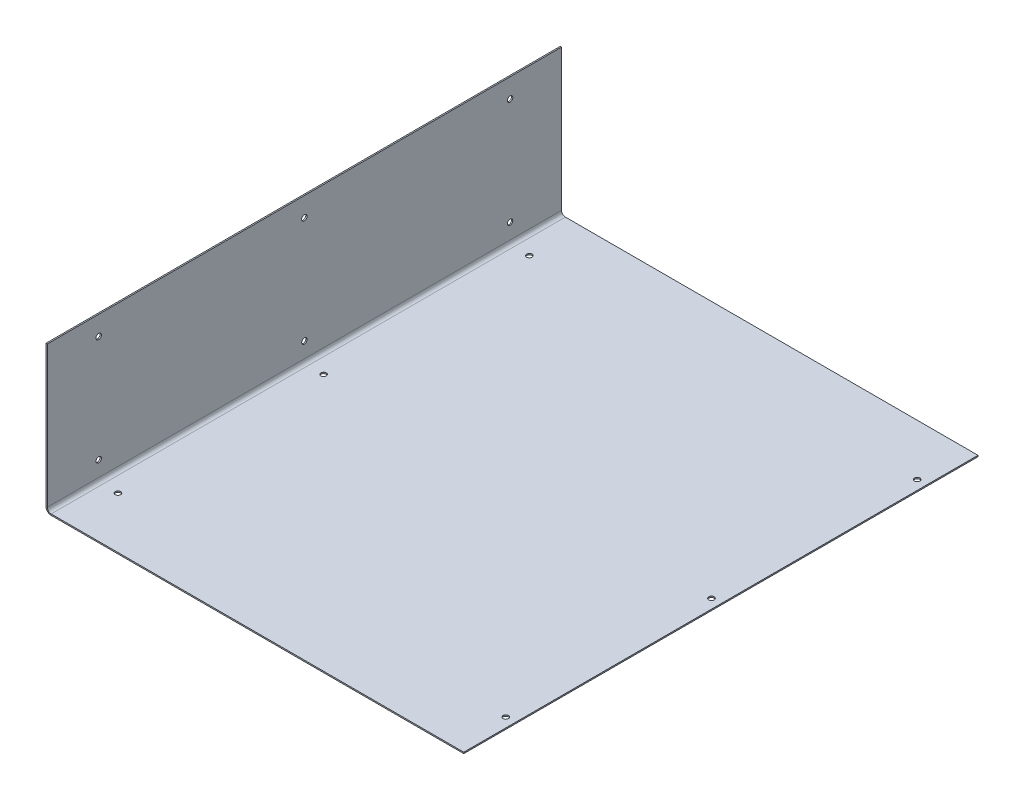
ISO-10303-21;
HEADER;
FILE_DESCRIPTION(('STEP AP214'),'2;1');
FILE_NAME('part.step','',(''),(''),'','','');
FILE_SCHEMA(('AUTOMOTIVE_DESIGN { 1 0 10303 214 1 1 1 1 }'));
ENDSEC;
DATA;
#1=APPLICATION_CONTEXT('core data for automotive mechanical design processes');
#2=APPLICATION_PROTOCOL_DEFINITION('international standard','automotive_design',2000,#1);
#3=PRODUCT_CONTEXT('',#1,'mechanical');
#4=PRODUCT('Part','Part','',(#3));
#5=PRODUCT_RELATED_PRODUCT_CATEGORY('part','',(#4));
#6=PRODUCT_DEFINITION_FORMATION('','',#4);
#7=PRODUCT_DEFINITION_CONTEXT('part definition',#1,'design');
#8=PRODUCT_DEFINITION('design','',#6,#7);
#9=PRODUCT_DEFINITION_SHAPE('','',#8);
#10=(LENGTH_UNIT() NAMED_UNIT(*) SI_UNIT(.MILLI.,.METRE.));
#11=(NAMED_UNIT(*) PLANE_ANGLE_UNIT() SI_UNIT($,.RADIAN.));
#12=(NAMED_UNIT(*) SI_UNIT($,.STERADIAN.) SOLID_ANGLE_UNIT());
#13=UNCERTAINTY_MEASURE_WITH_UNIT(LENGTH_MEASURE(1.E-05),#10,'distance_accuracy_value','');
#14=(GEOMETRIC_REPRESENTATION_CONTEXT(3) GLOBAL_UNCERTAINTY_ASSIGNED_CONTEXT((#13)) GLOBAL_UNIT_ASSIGNED_CONTEXT((#10,
#11,#12)) REPRESENTATION_CONTEXT('',''));
#15=CARTESIAN_POINT('',(0.,0.,0.));
#16=DIRECTION('',(0.,0.,1.));
#17=DIRECTION('',(1.,0.,0.));
#18=AXIS2_PLACEMENT_3D('',#15,#16,#17);
#19=CARTESIAN_POINT('',(-1.,57.,-200.));
#20=DIRECTION('',(0.,0.,-1.));
#21=DIRECTION('',(-1.,0.,0.));
#22=AXIS2_PLACEMENT_3D('',#19,#20,#21);
#23=PLANE('',#22);
#24=DIRECTION('',(0.,1.,0.));
#25=VECTOR('',#24,1.);
#26=CARTESIAN_POINT('',(0.,57.,-200.));
#27=LINE('',#26,#25);
#28=CARTESIAN_POINT('',(0.,-53.,-200.));
#29=VERTEX_POINT('',#28);
#30=CARTESIAN_POINT('',(0.,57.,-200.));
#31=VERTEX_POINT('',#30);
#32=EDGE_CURVE('E107',#29,#31,#27,.T.);
#33=ORIENTED_EDGE('',*,*,#32,.F.);
#34=DIRECTION('',(-1.,0.,0.));
#35=VECTOR('',#34,1.);
#36=CARTESIAN_POINT('',(0.,-53.,-200.));
#37=LINE('',#36,#35);
#38=CARTESIAN_POINT('',(-0.999999999999997,-53.,-200.));
#39=VERTEX_POINT('',#38);
#40=EDGE_CURVE('E232',#29,#39,#37,.T.);
#41=ORIENTED_EDGE('',*,*,#40,.T.);
#42=DIRECTION('',(0.,1.,0.));
#43=VECTOR('',#42,1.);
#44=CARTESIAN_POINT('',(-1.,57.,-200.));
#45=LINE('',#44,#43);
#46=CARTESIAN_POINT('',(-1.,57.,-200.));
#47=VERTEX_POINT('',#46);
#48=EDGE_CURVE('E104',#39,#47,#45,.T.);
#49=ORIENTED_EDGE('',*,*,#48,.T.);
#50=DIRECTION('',(1.,0.,0.));
#51=VECTOR('',#50,1.);
#52=CARTESIAN_POINT('',(-1.,57.,-200.));
#53=LINE('',#52,#51);
#54=EDGE_CURVE('E65',#47,#31,#53,.T.);
#55=ORIENTED_EDGE('',*,*,#54,.T.);
#56=EDGE_LOOP('',(#33,#41,#49,#55));
#57=FACE_BOUND('',#56,.T.);
#58=ADVANCED_FACE('F57',(#57),#23,.T.);
#59=CARTESIAN_POINT('',(-1.,0.,0.));
#60=DIRECTION('',(1.,0.,0.));
#61=DIRECTION('',(0.,0.,-1.));
#62=AXIS2_PLACEMENT_3D('',#59,#60,#61);
#63=PLANE('',#62);
#64=CARTESIAN_POINT('',(-1.00000000000044,-40.999999999999,-159.999999999999));
#65=DIRECTION('',(-1.,0.,0.));
#66=DIRECTION('',(0.,0.,1.));
#67=AXIS2_PLACEMENT_3D('',#64,#65,#66);
#68=CIRCLE('',#67,2.1);
#69=CARTESIAN_POINT('',(-1.00000000000044,-40.999999999999,-157.899999999999));
#70=VERTEX_POINT('',#69);
#71=EDGE_CURVE('E137',#70,#70,#68,.T.);
#72=ORIENTED_EDGE('',*,*,#71,.F.);
#73=EDGE_LOOP('',(#72));
#74=FACE_BOUND('',#73,.T.);
#75=CARTESIAN_POINT('',(-1.00000000000044,-40.9999999999993,6.66133814775094E-13));
#76=DIRECTION('',(-1.,0.,0.));
#77=DIRECTION('',(0.,0.,1.));
#78=AXIS2_PLACEMENT_3D('',#75,#76,#77);
#79=CIRCLE('',#78,2.1);
#80=CARTESIAN_POINT('',(-1.00000000000044,-40.9999999999993,2.10000000000066));
#81=VERTEX_POINT('',#80);
#82=EDGE_CURVE('E133',#81,#81,#79,.T.);
#83=ORIENTED_EDGE('',*,*,#82,.F.);
#84=EDGE_LOOP('',(#83));
#85=FACE_BOUND('',#84,.T.);
#86=CARTESIAN_POINT('',(-1.00000000000044,-40.9999999999995,160.000000000001));
#87=DIRECTION('',(-1.,0.,0.));
#88=DIRECTION('',(0.,0.,1.));
#89=AXIS2_PLACEMENT_3D('',#86,#87,#88);
#90=CIRCLE('',#89,2.1);
#91=CARTESIAN_POINT('',(-1.00000000000044,-40.9999999999995,162.100000000001));
#92=VERTEX_POINT('',#91);
#93=EDGE_CURVE('E132',#92,#92,#90,.T.);
#94=ORIENTED_EDGE('',*,*,#93,.F.);
#95=EDGE_LOOP('',(#94));
#96=FACE_BOUND('',#95,.T.);
#97=CARTESIAN_POINT('',(-1.00000000000311,42.0000000000027,160.000000000001));
#98=DIRECTION('',(-1.,0.,0.));
#99=DIRECTION('',(0.,0.,1.));
#100=AXIS2_PLACEMENT_3D('',#97,#98,#99);
#101=CIRCLE('',#100,2.1);
#102=CARTESIAN_POINT('',(-1.00000000000311,42.0000000000027,162.100000000001));
#103=VERTEX_POINT('',#102);
#104=EDGE_CURVE('E128',#103,#103,#101,.T.);
#105=ORIENTED_EDGE('',*,*,#104,.F.);
#106=EDGE_LOOP('',(#105));
#107=FACE_BOUND('',#106,.T.);
#108=CARTESIAN_POINT('',(-1.00000000000311,42.0000000000029,9.99200722162641E-13));
#109=DIRECTION('',(-1.,0.,0.));
#110=DIRECTION('',(0.,0.,1.));
#111=AXIS2_PLACEMENT_3D('',#108,#109,#110);
#112=CIRCLE('',#111,2.1);
#113=CARTESIAN_POINT('',(-1.00000000000311,42.0000000000029,2.100000000001));
#114=VERTEX_POINT('',#113);
#115=EDGE_CURVE('E124',#114,#114,#112,.T.);
#116=ORIENTED_EDGE('',*,*,#115,.F.);
#117=EDGE_LOOP('',(#116));
#118=FACE_BOUND('',#117,.T.);
#119=CARTESIAN_POINT('',(-1.00000000000311,42.000000000003,-159.999999999999));
#120=DIRECTION('',(-1.,0.,0.));
#121=DIRECTION('',(0.,0.,1.));
#122=AXIS2_PLACEMENT_3D('',#119,#120,#121);
#123=CIRCLE('',#122,2.1);
#124=CARTESIAN_POINT('',(-1.00000000000311,42.000000000003,-157.899999999999));
#125=VERTEX_POINT('',#124);
#126=EDGE_CURVE('E123',#125,#125,#123,.T.);
#127=ORIENTED_EDGE('',*,*,#126,.F.);
#128=EDGE_LOOP('',(#127));
#129=FACE_BOUND('',#128,.T.);
#130=DIRECTION('',(0.,0.,-1.));
#131=VECTOR('',#130,1.);
#132=CARTESIAN_POINT('',(-0.999999999999997,-53.,-200.));
#133=LINE('',#132,#131);
#134=CARTESIAN_POINT('',(-1.,-53.,200.));
#135=VERTEX_POINT('',#134);
#136=EDGE_CURVE('E225',#39,#135,#133,.F.);
#137=ORIENTED_EDGE('',*,*,#136,.T.);
#138=DIRECTION('',(0.,-1.,0.));
#139=VECTOR('',#138,1.);
#140=CARTESIAN_POINT('',(-1.,57.,200.));
#141=LINE('',#140,#139);
#142=CARTESIAN_POINT('',(-1.,57.,200.));
#143=VERTEX_POINT('',#142);
#144=EDGE_CURVE('E114',#143,#135,#141,.T.);
#145=ORIENTED_EDGE('',*,*,#144,.F.);
#146=DIRECTION('',(0.,0.,1.));
#147=VECTOR('',#146,1.);
#148=CARTESIAN_POINT('',(-1.,57.,200.));
#149=LINE('',#148,#147);
#150=EDGE_CURVE('E97',#47,#143,#149,.T.);
#151=ORIENTED_EDGE('',*,*,#150,.F.);
#152=ORIENTED_EDGE('',*,*,#48,.F.);
#153=EDGE_LOOP('',(#137,#145,#151,#152));
#154=FACE_BOUND('',#153,.T.);
#155=ADVANCED_FACE('F300',(#74,#85,#96,#107,#118,#129,#154),#63,.F.);
#156=CARTESIAN_POINT('',(0.,0.,0.));
#157=DIRECTION('',(1.,0.,0.));
#158=DIRECTION('',(0.,0.,-1.));
#159=AXIS2_PLACEMENT_3D('',#156,#157,#158);
#160=PLANE('',#159);
#161=CARTESIAN_POINT('',(0.,-40.999999999999,-159.999999999999));
#162=DIRECTION('',(1.,0.,0.));
#163=DIRECTION('',(0.,0.,-1.));
#164=AXIS2_PLACEMENT_3D('',#161,#162,#163);
#165=CIRCLE('',#164,2.1);
#166=CARTESIAN_POINT('',(0.,-40.999999999999,-162.099999999999));
#167=VERTEX_POINT('',#166);
#168=EDGE_CURVE('E134',#167,#167,#165,.T.);
#169=ORIENTED_EDGE('',*,*,#168,.F.);
#170=EDGE_LOOP('',(#169));
#171=FACE_BOUND('',#170,.T.);
#172=CARTESIAN_POINT('',(0.,-40.9999999999993,6.66133814775094E-13));
#173=DIRECTION('',(1.,0.,0.));
#174=DIRECTION('',(0.,0.,-1.));
#175=AXIS2_PLACEMENT_3D('',#172,#173,#174);
#176=CIRCLE('',#175,2.1);
#177=CARTESIAN_POINT('',(0.,-40.9999999999993,-2.09999999999933));
#178=VERTEX_POINT('',#177);
#179=EDGE_CURVE('E129',#178,#178,#176,.T.);
#180=ORIENTED_EDGE('',*,*,#179,.F.);
#181=EDGE_LOOP('',(#180));
#182=FACE_BOUND('',#181,.T.);
#183=CARTESIAN_POINT('',(0.,-40.9999999999995,160.000000000001));
#184=DIRECTION('',(1.,0.,0.));
#185=DIRECTION('',(0.,0.,-1.));
#186=AXIS2_PLACEMENT_3D('',#183,#184,#185);
#187=CIRCLE('',#186,2.1);
#188=CARTESIAN_POINT('',(0.,-40.9999999999995,157.900000000001));
#189=VERTEX_POINT('',#188);
#190=EDGE_CURVE('E163',#189,#189,#187,.T.);
#191=ORIENTED_EDGE('',*,*,#190,.F.);
#192=EDGE_LOOP('',(#191));
#193=FACE_BOUND('',#192,.T.);
#194=CARTESIAN_POINT('',(0.,42.0000000000027,160.000000000001));
#195=DIRECTION('',(1.,0.,0.));
#196=DIRECTION('',(0.,0.,-1.));
#197=AXIS2_PLACEMENT_3D('',#194,#195,#196);
#198=CIRCLE('',#197,2.1);
#199=CARTESIAN_POINT('',(0.,42.0000000000027,157.900000000001));
#200=VERTEX_POINT('',#199);
#201=EDGE_CURVE('E125',#200,#200,#198,.T.);
#202=ORIENTED_EDGE('',*,*,#201,.F.);
#203=EDGE_LOOP('',(#202));
#204=FACE_BOUND('',#203,.T.);
#205=CARTESIAN_POINT('',(0.,42.0000000000029,9.99200722162641E-13));
#206=DIRECTION('',(1.,0.,0.));
#207=DIRECTION('',(0.,0.,-1.));
#208=AXIS2_PLACEMENT_3D('',#205,#206,#207);
#209=CIRCLE('',#208,2.1);
#210=CARTESIAN_POINT('',(0.,42.0000000000029,-2.099999999999));
#211=VERTEX_POINT('',#210);
#212=EDGE_CURVE('E120',#211,#211,#209,.T.);
#213=ORIENTED_EDGE('',*,*,#212,.F.);
#214=EDGE_LOOP('',(#213));
#215=FACE_BOUND('',#214,.T.);
#216=CARTESIAN_POINT('',(0.,42.000000000003,-159.999999999999));
#217=DIRECTION('',(1.,0.,0.));
#218=DIRECTION('',(0.,0.,-1.));
#219=AXIS2_PLACEMENT_3D('',#216,#217,#218);
#220=CIRCLE('',#219,2.1);
#221=CARTESIAN_POINT('',(0.,42.000000000003,-162.099999999999));
#222=VERTEX_POINT('',#221);
#223=EDGE_CURVE('E172',#222,#222,#220,.T.);
#224=ORIENTED_EDGE('',*,*,#223,.F.);
#225=EDGE_LOOP('',(#224));
#226=FACE_BOUND('',#225,.T.);
#227=DIRECTION('',(0.,-1.,0.));
#228=VECTOR('',#227,1.);
#229=CARTESIAN_POINT('',(0.,57.,200.));
#230=LINE('',#229,#228);
#231=CARTESIAN_POINT('',(0.,57.,200.));
#232=VERTEX_POINT('',#231);
#233=CARTESIAN_POINT('',(0.,-53.,200.));
#234=VERTEX_POINT('',#233);
#235=EDGE_CURVE('E99',#232,#234,#230,.T.);
#236=ORIENTED_EDGE('',*,*,#235,.T.);
#237=DIRECTION('',(0.,0.,-1.));
#238=VECTOR('',#237,1.);
#239=CARTESIAN_POINT('',(0.,-53.,-200.));
#240=LINE('',#239,#238);
#241=EDGE_CURVE('E73',#29,#234,#240,.F.);
#242=ORIENTED_EDGE('',*,*,#241,.F.);
#243=ORIENTED_EDGE('',*,*,#32,.T.);
#244=DIRECTION('',(0.,0.,1.));
#245=VECTOR('',#244,1.);
#246=CARTESIAN_POINT('',(0.,57.,200.));
#247=LINE('',#246,#245);
#248=EDGE_CURVE('E95',#31,#232,#247,.T.);
#249=ORIENTED_EDGE('',*,*,#248,.T.);
#250=EDGE_LOOP('',(#236,#242,#243,#249));
#251=FACE_BOUND('',#250,.T.);
#252=ADVANCED_FACE('F106',(#171,#182,#193,#204,#215,#226,#251),#160,.T.);
#253=CARTESIAN_POINT('',(-1.,57.,200.));
#254=DIRECTION('',(0.,0.,1.));
#255=DIRECTION('',(0.,-1.,0.));
#256=AXIS2_PLACEMENT_3D('',#253,#254,#255);
#257=PLANE('',#256);
#258=DIRECTION('',(-1.,0.,0.));
#259=VECTOR('',#258,1.);
#260=CARTESIAN_POINT('',(0.,-53.,200.));
#261=LINE('',#260,#259);
#262=EDGE_CURVE('E103',#234,#135,#261,.T.);
#263=ORIENTED_EDGE('',*,*,#262,.F.);
#264=ORIENTED_EDGE('',*,*,#235,.F.);
#265=DIRECTION('',(1.,0.,0.));
#266=VECTOR('',#265,1.);
#267=CARTESIAN_POINT('',(-1.,57.,200.));
#268=LINE('',#267,#266);
#269=EDGE_CURVE('E13',#143,#232,#268,.T.);
#270=ORIENTED_EDGE('',*,*,#269,.F.);
#271=ORIENTED_EDGE('',*,*,#144,.T.);
#272=EDGE_LOOP('',(#263,#264,#270,#271));
#273=FACE_BOUND('',#272,.T.);
#274=ADVANCED_FACE('F100',(#273),#257,.T.);
#275=CARTESIAN_POINT('',(-1.,57.,200.));
#276=DIRECTION('',(0.,1.,0.));
#277=DIRECTION('',(0.,0.,1.));
#278=AXIS2_PLACEMENT_3D('',#275,#276,#277);
#279=PLANE('',#278);
#280=ORIENTED_EDGE('',*,*,#248,.F.);
#281=ORIENTED_EDGE('',*,*,#54,.F.);
#282=ORIENTED_EDGE('',*,*,#150,.T.);
#283=ORIENTED_EDGE('',*,*,#269,.T.);
#284=EDGE_LOOP('',(#280,#281,#282,#283));
#285=FACE_BOUND('',#284,.T.);
#286=ADVANCED_FACE('F92',(#285),#279,.T.);
#287=CARTESIAN_POINT('',(3.00000000000001,-53.,200.));
#288=DIRECTION('',(0.,0.,1.));
#289=DIRECTION('',(1.,0.,0.));
#290=AXIS2_PLACEMENT_3D('',#287,#288,#289);
#291=PLANE('',#290);
#292=DIRECTION('',(0.,1.,0.));
#293=VECTOR('',#292,1.);
#294=CARTESIAN_POINT('',(2.99999999999999,-57.,200.));
#295=LINE('',#294,#293);
#296=CARTESIAN_POINT('',(3.,-56.,200.));
#297=VERTEX_POINT('',#296);
#298=CARTESIAN_POINT('',(2.99999999999999,-57.,200.));
#299=VERTEX_POINT('',#298);
#300=EDGE_CURVE('E118',#297,#299,#295,.F.);
#301=ORIENTED_EDGE('',*,*,#300,.F.);
#302=CARTESIAN_POINT('',(3.00000000000001,-53.,200.));
#303=DIRECTION('',(0.,0.,-1.));
#304=DIRECTION('',(-1.,0.,0.));
#305=AXIS2_PLACEMENT_3D('',#302,#303,#304);
#306=CIRCLE('',#305,3.);
#307=EDGE_CURVE('E235',#234,#297,#306,.F.);
#308=ORIENTED_EDGE('',*,*,#307,.F.);
#309=ORIENTED_EDGE('',*,*,#262,.T.);
#310=CARTESIAN_POINT('',(3.00000000000001,-53.,200.));
#311=DIRECTION('',(0.,0.,-1.));
#312=DIRECTION('',(-1.,0.,0.));
#313=AXIS2_PLACEMENT_3D('',#310,#311,#312);
#314=CIRCLE('',#313,4.);
#315=EDGE_CURVE('E228',#135,#299,#314,.F.);
#316=ORIENTED_EDGE('',*,*,#315,.T.);
#317=EDGE_LOOP('',(#301,#308,#309,#316));
#318=FACE_BOUND('',#317,.T.);
#319=ADVANCED_FACE('F250',(#318),#291,.T.);
#320=CARTESIAN_POINT('',(3.00000000000001,-53.,-200.));
#321=DIRECTION('',(0.,0.,1.));
#322=DIRECTION('',(1.,0.,0.));
#323=AXIS2_PLACEMENT_3D('',#320,#321,#322);
#324=PLANE('',#323);
#325=CARTESIAN_POINT('',(3.00000000000001,-53.,-200.));
#326=DIRECTION('',(0.,0.,-1.));
#327=DIRECTION('',(-1.,0.,0.));
#328=AXIS2_PLACEMENT_3D('',#325,#326,#327);
#329=CIRCLE('',#328,3.);
#330=CARTESIAN_POINT('',(3.,-56.,-200.));
#331=VERTEX_POINT('',#330);
#332=EDGE_CURVE('E192',#331,#29,#329,.T.);
#333=ORIENTED_EDGE('',*,*,#332,.F.);
#334=DIRECTION('',(0.,1.,0.));
#335=VECTOR('',#334,1.);
#336=CARTESIAN_POINT('',(3.,-56.,-200.));
#337=LINE('',#336,#335);
#338=CARTESIAN_POINT('',(3.,-57.,-200.));
#339=VERTEX_POINT('',#338);
#340=EDGE_CURVE('E217',#331,#339,#337,.F.);
#341=ORIENTED_EDGE('',*,*,#340,.T.);
#342=CARTESIAN_POINT('',(3.00000000000001,-53.,-200.));
#343=DIRECTION('',(0.,0.,-1.));
#344=DIRECTION('',(-1.,0.,0.));
#345=AXIS2_PLACEMENT_3D('',#342,#343,#344);
#346=CIRCLE('',#345,4.);
#347=EDGE_CURVE('E229',#339,#39,#346,.T.);
#348=ORIENTED_EDGE('',*,*,#347,.T.);
#349=ORIENTED_EDGE('',*,*,#40,.F.);
#350=EDGE_LOOP('',(#333,#341,#348,#349));
#351=FACE_BOUND('',#350,.T.);
#352=ADVANCED_FACE('F298',(#351),#324,.F.);
#353=CARTESIAN_POINT('',(3.00000000000001,-53.,-200.));
#354=DIRECTION('',(0.,0.,-1.));
#355=DIRECTION('',(0.,-1.,0.));
#356=AXIS2_PLACEMENT_3D('',#353,#354,#355);
#357=CYLINDRICAL_SURFACE('',#356,4.);
#358=ORIENTED_EDGE('',*,*,#136,.F.);
#359=ORIENTED_EDGE('',*,*,#347,.F.);
#360=DIRECTION('',(0.,0.,-1.));
#361=VECTOR('',#360,1.);
#362=CARTESIAN_POINT('',(2.99999999999999,-57.,200.));
#363=LINE('',#362,#361);
#364=EDGE_CURVE('E214',#339,#299,#363,.F.);
#365=ORIENTED_EDGE('',*,*,#364,.T.);
#366=ORIENTED_EDGE('',*,*,#315,.F.);
#367=EDGE_LOOP('',(#358,#359,#365,#366));
#368=FACE_BOUND('',#367,.T.);
#369=ADVANCED_FACE('F254',(#368),#357,.T.);
#370=CARTESIAN_POINT('',(3.00000000000001,-53.,-200.));
#371=DIRECTION('',(0.,0.,-1.));
#372=DIRECTION('',(0.,-1.,0.));
#373=AXIS2_PLACEMENT_3D('',#370,#371,#372);
#374=CYLINDRICAL_SURFACE('',#373,3.);
#375=ORIENTED_EDGE('',*,*,#241,.T.);
#376=ORIENTED_EDGE('',*,*,#307,.T.);
#377=DIRECTION('',(0.,0.,-1.));
#378=VECTOR('',#377,1.);
#379=CARTESIAN_POINT('',(2.99999999999999,-56.,200.));
#380=LINE('',#379,#378);
#381=EDGE_CURVE('E220',#297,#331,#380,.T.);
#382=ORIENTED_EDGE('',*,*,#381,.T.);
#383=ORIENTED_EDGE('',*,*,#332,.T.);
#384=EDGE_LOOP('',(#375,#376,#382,#383));
#385=FACE_BOUND('',#384,.T.);
#386=ADVANCED_FACE('F293',(#385),#374,.F.);
#387=CARTESIAN_POINT('',(324.,-57.0000000000011,-200.));
#388=DIRECTION('',(0.,0.,1.));
#389=DIRECTION('',(1.,0.,0.));
#390=AXIS2_PLACEMENT_3D('',#387,#388,#389);
#391=PLANE('',#390);
#392=ORIENTED_EDGE('',*,*,#340,.F.);
#393=DIRECTION('',(-1.,0.,0.));
#394=VECTOR('',#393,1.);
#395=CARTESIAN_POINT('',(324.,-56.0000000000011,-200.));
#396=LINE('',#395,#394);
#397=CARTESIAN_POINT('',(324.,-56.0000000000011,-200.));
#398=VERTEX_POINT('',#397);
#399=EDGE_CURVE('E211',#331,#398,#396,.F.);
#400=ORIENTED_EDGE('',*,*,#399,.T.);
#401=DIRECTION('',(0.,1.,0.));
#402=VECTOR('',#401,1.);
#403=CARTESIAN_POINT('',(324.,-57.0000000000011,-200.));
#404=LINE('',#403,#402);
#405=CARTESIAN_POINT('',(324.,-57.0000000000011,-200.));
#406=VERTEX_POINT('',#405);
#407=EDGE_CURVE('E189',#406,#398,#404,.T.);
#408=ORIENTED_EDGE('',*,*,#407,.F.);
#409=DIRECTION('',(1.,0.,0.));
#410=VECTOR('',#409,1.);
#411=CARTESIAN_POINT('',(-1.16805332096785E-13,-57.,-200.));
#412=LINE('',#411,#410);
#413=EDGE_CURVE('E202',#339,#406,#412,.T.);
#414=ORIENTED_EDGE('',*,*,#413,.F.);
#415=EDGE_LOOP('',(#392,#400,#408,#414));
#416=FACE_BOUND('',#415,.T.);
#417=ADVANCED_FACE('F271',(#416),#391,.F.);
#418=CARTESIAN_POINT('',(0.,-57.,200.));
#419=DIRECTION('',(0.,0.,-1.));
#420=DIRECTION('',(-1.,0.,0.));
#421=AXIS2_PLACEMENT_3D('',#418,#419,#420);
#422=PLANE('',#421);
#423=ORIENTED_EDGE('',*,*,#300,.T.);
#424=DIRECTION('',(-1.,0.,0.));
#425=VECTOR('',#424,1.);
#426=CARTESIAN_POINT('',(-3.56668331244195E-13,-57.,200.));
#427=LINE('',#426,#425);
#428=CARTESIAN_POINT('',(324.,-57.0000000000011,200.));
#429=VERTEX_POINT('',#428);
#430=EDGE_CURVE('E196',#429,#299,#427,.T.);
#431=ORIENTED_EDGE('',*,*,#430,.F.);
#432=DIRECTION('',(0.,1.,0.));
#433=VECTOR('',#432,1.);
#434=CARTESIAN_POINT('',(324.,-57.0000000000011,200.));
#435=LINE('',#434,#433);
#436=CARTESIAN_POINT('',(324.,-56.0000000000011,200.));
#437=VERTEX_POINT('',#436);
#438=EDGE_CURVE('E193',#429,#437,#435,.T.);
#439=ORIENTED_EDGE('',*,*,#438,.T.);
#440=DIRECTION('',(1.,0.,0.));
#441=VECTOR('',#440,1.);
#442=CARTESIAN_POINT('',(0.,-56.,200.));
#443=LINE('',#442,#441);
#444=EDGE_CURVE('E205',#437,#297,#443,.F.);
#445=ORIENTED_EDGE('',*,*,#444,.T.);
#446=EDGE_LOOP('',(#423,#431,#439,#445));
#447=FACE_BOUND('',#446,.T.);
#448=ADVANCED_FACE('F330',(#447),#422,.F.);
#449=CARTESIAN_POINT('',(-2.02470688935146E-13,-57.,0.));
#450=DIRECTION('',(0.,1.,0.));
#451=DIRECTION('',(-1.,0.,0.));
#452=AXIS2_PLACEMENT_3D('',#449,#450,#451);
#453=PLANE('',#452);
#454=CARTESIAN_POINT('',(316.678974836989,-57.0000000000011,-159.999999999999));
#455=DIRECTION('',(0.,1.,0.));
#456=DIRECTION('',(-1.,0.,0.));
#457=AXIS2_PLACEMENT_3D('',#454,#455,#456);
#458=CIRCLE('',#457,2.09999999999999);
#459=CARTESIAN_POINT('',(314.578974836989,-57.0000000000011,-159.999999999999));
#460=VERTEX_POINT('',#459);
#461=EDGE_CURVE('E144',#460,#460,#458,.T.);
#462=ORIENTED_EDGE('',*,*,#461,.T.);
#463=EDGE_LOOP('',(#462));
#464=FACE_BOUND('',#463,.T.);
#465=CARTESIAN_POINT('',(316.678974836989,-57.0000000000011,1.11022302462516E-12));
#466=DIRECTION('',(0.,1.,0.));
#467=DIRECTION('',(-1.,0.,0.));
#468=AXIS2_PLACEMENT_3D('',#465,#466,#467);
#469=CIRCLE('',#468,2.09999999999999);
#470=CARTESIAN_POINT('',(314.57897483699,-57.0000000000011,1.11022302462516E-12));
#471=VERTEX_POINT('',#470);
#472=EDGE_CURVE('E141',#471,#471,#469,.T.);
#473=ORIENTED_EDGE('',*,*,#472,.T.);
#474=EDGE_LOOP('',(#473));
#475=FACE_BOUND('',#474,.T.);
#476=CARTESIAN_POINT('',(316.67897483699,-57.0000000000011,160.000000000001));
#477=DIRECTION('',(0.,1.,0.));
#478=DIRECTION('',(-1.,0.,0.));
#479=AXIS2_PLACEMENT_3D('',#476,#477,#478);
#480=CIRCLE('',#479,2.09999999999999);
#481=CARTESIAN_POINT('',(314.57897483699,-57.0000000000011,160.000000000001));
#482=VERTEX_POINT('',#481);
#483=EDGE_CURVE('E140',#482,#482,#480,.T.);
#484=ORIENTED_EDGE('',*,*,#483,.T.);
#485=EDGE_LOOP('',(#484));
#486=FACE_BOUND('',#485,.T.);
#487=CARTESIAN_POINT('',(14.9999999999993,-57.0000000000001,160.000000000001));
#488=DIRECTION('',(0.,-1.,0.));
#489=DIRECTION('',(0.,0.,-1.));
#490=AXIS2_PLACEMENT_3D('',#487,#488,#489);
#491=CIRCLE('',#490,2.1);
#492=CARTESIAN_POINT('',(14.9999999999993,-57.0000000000001,157.900000000001));
#493=VERTEX_POINT('',#492);
#494=EDGE_CURVE('E175',#493,#493,#491,.T.);
#495=ORIENTED_EDGE('',*,*,#494,.F.);
#496=EDGE_LOOP('',(#495));
#497=FACE_BOUND('',#496,.T.);
#498=CARTESIAN_POINT('',(14.9999999999993,-57.,5.55111512312578E-13));
#499=DIRECTION('',(0.,-1.,0.));
#500=DIRECTION('',(0.,0.,-1.));
#501=AXIS2_PLACEMENT_3D('',#498,#499,#500);
#502=CIRCLE('',#501,2.1);
#503=CARTESIAN_POINT('',(14.9999999999993,-57.,-2.09999999999945));
#504=VERTEX_POINT('',#503);
#505=EDGE_CURVE('E181',#504,#504,#502,.T.);
#506=ORIENTED_EDGE('',*,*,#505,.F.);
#507=EDGE_LOOP('',(#506));
#508=FACE_BOUND('',#507,.T.);
#509=CARTESIAN_POINT('',(14.9999999999992,-57.,-159.999999999999));
#510=DIRECTION('',(0.,-1.,0.));
#511=DIRECTION('',(0.,0.,-1.));
#512=AXIS2_PLACEMENT_3D('',#509,#510,#511);
#513=CIRCLE('',#512,2.1);
#514=CARTESIAN_POINT('',(14.9999999999992,-57.,-162.099999999999));
#515=VERTEX_POINT('',#514);
#516=EDGE_CURVE('E119',#515,#515,#513,.T.);
#517=ORIENTED_EDGE('',*,*,#516,.F.);
#518=EDGE_LOOP('',(#517));
#519=FACE_BOUND('',#518,.T.);
#520=ORIENTED_EDGE('',*,*,#364,.F.);
#521=ORIENTED_EDGE('',*,*,#413,.T.);
#522=DIRECTION('',(0.,0.,1.));
#523=VECTOR('',#522,1.);
#524=CARTESIAN_POINT('',(324.,-57.0000000000011,0.));
#525=LINE('',#524,#523);
#526=EDGE_CURVE('E199',#406,#429,#525,.T.);
#527=ORIENTED_EDGE('',*,*,#526,.T.);
#528=ORIENTED_EDGE('',*,*,#430,.T.);
#529=EDGE_LOOP('',(#520,#521,#527,#528));
#530=FACE_BOUND('',#529,.T.);
#531=ADVANCED_FACE('F263',(#464,#475,#486,#497,#508,#519,#530),#453,.F.);
#532=CARTESIAN_POINT('',(-1.98979207596303E-13,-56.,0.));
#533=DIRECTION('',(0.,1.,0.));
#534=DIRECTION('',(-1.,0.,0.));
#535=AXIS2_PLACEMENT_3D('',#532,#533,#534);
#536=PLANE('',#535);
#537=CARTESIAN_POINT('',(316.678974836989,-56.0000000000011,-159.999999999999));
#538=DIRECTION('',(0.,1.,0.));
#539=DIRECTION('',(-1.,0.,0.));
#540=AXIS2_PLACEMENT_3D('',#537,#538,#539);
#541=CIRCLE('',#540,2.09999999999999);
#542=CARTESIAN_POINT('',(314.578974836989,-56.0000000000011,-159.999999999999));
#543=VERTEX_POINT('',#542);
#544=EDGE_CURVE('E60',#543,#543,#541,.T.);
#545=ORIENTED_EDGE('',*,*,#544,.F.);
#546=EDGE_LOOP('',(#545));
#547=FACE_BOUND('',#546,.T.);
#548=CARTESIAN_POINT('',(316.678974836989,-56.0000000000011,1.11022302462516E-12));
#549=DIRECTION('',(0.,1.,0.));
#550=DIRECTION('',(-1.,0.,0.));
#551=AXIS2_PLACEMENT_3D('',#548,#549,#550);
#552=CIRCLE('',#551,2.09999999999999);
#553=CARTESIAN_POINT('',(314.57897483699,-56.0000000000011,1.11022302462516E-12));
#554=VERTEX_POINT('',#553);
#555=EDGE_CURVE('E142',#554,#554,#552,.T.);
#556=ORIENTED_EDGE('',*,*,#555,.F.);
#557=EDGE_LOOP('',(#556));
#558=FACE_BOUND('',#557,.T.);
#559=CARTESIAN_POINT('',(316.67897483699,-56.0000000000011,160.000000000001));
#560=DIRECTION('',(0.,1.,0.));
#561=DIRECTION('',(-1.,0.,0.));
#562=AXIS2_PLACEMENT_3D('',#559,#560,#561);
#563=CIRCLE('',#562,2.09999999999999);
#564=CARTESIAN_POINT('',(314.57897483699,-56.0000000000011,160.000000000001));
#565=VERTEX_POINT('',#564);
#566=EDGE_CURVE('E138',#565,#565,#563,.T.);
#567=ORIENTED_EDGE('',*,*,#566,.F.);
#568=EDGE_LOOP('',(#567));
#569=FACE_BOUND('',#568,.T.);
#570=CARTESIAN_POINT('',(14.9999999999993,-56.0000000000001,160.000000000001));
#571=DIRECTION('',(0.,1.,0.));
#572=DIRECTION('',(-1.,0.,0.));
#573=AXIS2_PLACEMENT_3D('',#570,#571,#572);
#574=CIRCLE('',#573,2.1);
#575=CARTESIAN_POINT('',(12.8999999999993,-56.,160.000000000001));
#576=VERTEX_POINT('',#575);
#577=EDGE_CURVE('E178',#576,#576,#574,.T.);
#578=ORIENTED_EDGE('',*,*,#577,.F.);
#579=EDGE_LOOP('',(#578));
#580=FACE_BOUND('',#579,.T.);
#581=CARTESIAN_POINT('',(14.9999999999993,-56.0000000000001,5.55111512312578E-13));
#582=DIRECTION('',(0.,1.,0.));
#583=DIRECTION('',(-1.,0.,0.));
#584=AXIS2_PLACEMENT_3D('',#581,#582,#583);
#585=CIRCLE('',#584,2.1);
#586=CARTESIAN_POINT('',(12.8999999999993,-56.,5.55111512312578E-13));
#587=VERTEX_POINT('',#586);
#588=EDGE_CURVE('E184',#587,#587,#585,.T.);
#589=ORIENTED_EDGE('',*,*,#588,.F.);
#590=EDGE_LOOP('',(#589));
#591=FACE_BOUND('',#590,.T.);
#592=CARTESIAN_POINT('',(14.9999999999992,-56.0000000000001,-159.999999999999));
#593=DIRECTION('',(0.,1.,0.));
#594=DIRECTION('',(-1.,0.,0.));
#595=AXIS2_PLACEMENT_3D('',#592,#593,#594);
#596=CIRCLE('',#595,2.1);
#597=CARTESIAN_POINT('',(12.8999999999992,-56.,-159.999999999999));
#598=VERTEX_POINT('',#597);
#599=EDGE_CURVE('E115',#598,#598,#596,.T.);
#600=ORIENTED_EDGE('',*,*,#599,.F.);
#601=EDGE_LOOP('',(#600));
#602=FACE_BOUND('',#601,.T.);
#603=ORIENTED_EDGE('',*,*,#399,.F.);
#604=ORIENTED_EDGE('',*,*,#381,.F.);
#605=ORIENTED_EDGE('',*,*,#444,.F.);
#606=DIRECTION('',(0.,0.,-1.));
#607=VECTOR('',#606,1.);
#608=CARTESIAN_POINT('',(324.,-56.0000000000011,200.));
#609=LINE('',#608,#607);
#610=EDGE_CURVE('E208',#398,#437,#609,.F.);
#611=ORIENTED_EDGE('',*,*,#610,.F.);
#612=EDGE_LOOP('',(#603,#604,#605,#611));
#613=FACE_BOUND('',#612,.T.);
#614=ADVANCED_FACE('F334',(#547,#558,#569,#580,#591,#602,#613),#536,.T.);
#615=CARTESIAN_POINT('',(324.,-57.0000000000011,200.));
#616=DIRECTION('',(-1.,0.,0.));
#617=DIRECTION('',(0.,-1.,0.));
#618=AXIS2_PLACEMENT_3D('',#615,#616,#617);
#619=PLANE('',#618);
#620=ORIENTED_EDGE('',*,*,#610,.T.);
#621=ORIENTED_EDGE('',*,*,#438,.F.);
#622=ORIENTED_EDGE('',*,*,#526,.F.);
#623=ORIENTED_EDGE('',*,*,#407,.T.);
#624=EDGE_LOOP('',(#620,#621,#622,#623));
#625=FACE_BOUND('',#624,.T.);
#626=ADVANCED_FACE('F280',(#625),#619,.F.);
#627=CARTESIAN_POINT('',(14.9999999999992,-57.,-159.999999999999));
#628=DIRECTION('',(0.,-1.,0.));
#629=DIRECTION('',(0.,0.,-1.));
#630=AXIS2_PLACEMENT_3D('',#627,#628,#629);
#631=CYLINDRICAL_SURFACE('',#630,2.1);
#632=ORIENTED_EDGE('',*,*,#599,.T.);
#633=EDGE_LOOP('',(#632));
#634=FACE_BOUND('',#633,.T.);
#635=ORIENTED_EDGE('',*,*,#516,.T.);
#636=EDGE_LOOP('',(#635));
#637=FACE_BOUND('',#636,.T.);
#638=ADVANCED_FACE('F333',(#634,#637),#631,.F.);
#639=CARTESIAN_POINT('',(14.9999999999993,-57.,5.55111512312578E-13));
#640=DIRECTION('',(0.,-1.,0.));
#641=DIRECTION('',(0.,0.,-1.));
#642=AXIS2_PLACEMENT_3D('',#639,#640,#641);
#643=CYLINDRICAL_SURFACE('',#642,2.1);
#644=ORIENTED_EDGE('',*,*,#588,.T.);
#645=EDGE_LOOP('',(#644));
#646=FACE_BOUND('',#645,.T.);
#647=ORIENTED_EDGE('',*,*,#505,.T.);
#648=EDGE_LOOP('',(#647));
#649=FACE_BOUND('',#648,.T.);
#650=ADVANCED_FACE('F345',(#646,#649),#643,.F.);
#651=CARTESIAN_POINT('',(14.9999999999993,-57.0000000000001,160.000000000001));
#652=DIRECTION('',(0.,-1.,0.));
#653=DIRECTION('',(0.,0.,-1.));
#654=AXIS2_PLACEMENT_3D('',#651,#652,#653);
#655=CYLINDRICAL_SURFACE('',#654,2.1);
#656=ORIENTED_EDGE('',*,*,#577,.T.);
#657=EDGE_LOOP('',(#656));
#658=FACE_BOUND('',#657,.T.);
#659=ORIENTED_EDGE('',*,*,#494,.T.);
#660=EDGE_LOOP('',(#659));
#661=FACE_BOUND('',#660,.T.);
#662=ADVANCED_FACE('F349',(#658,#661),#655,.F.);
#663=CARTESIAN_POINT('',(-1.00000000000311,42.000000000003,-159.999999999999));
#664=DIRECTION('',(-1.,0.,0.));
#665=DIRECTION('',(0.,0.,1.));
#666=AXIS2_PLACEMENT_3D('',#663,#664,#665);
#667=CYLINDRICAL_SURFACE('',#666,2.1);
#668=ORIENTED_EDGE('',*,*,#223,.T.);
#669=EDGE_LOOP('',(#668));
#670=FACE_BOUND('',#669,.T.);
#671=ORIENTED_EDGE('',*,*,#126,.T.);
#672=EDGE_LOOP('',(#671));
#673=FACE_BOUND('',#672,.T.);
#674=ADVANCED_FACE('F353',(#670,#673),#667,.F.);
#675=CARTESIAN_POINT('',(-1.00000000000311,42.0000000000029,9.99200722162641E-13));
#676=DIRECTION('',(-1.,0.,0.));
#677=DIRECTION('',(0.,0.,1.));
#678=AXIS2_PLACEMENT_3D('',#675,#676,#677);
#679=CYLINDRICAL_SURFACE('',#678,2.1);
#680=ORIENTED_EDGE('',*,*,#212,.T.);
#681=EDGE_LOOP('',(#680));
#682=FACE_BOUND('',#681,.T.);
#683=ORIENTED_EDGE('',*,*,#115,.T.);
#684=EDGE_LOOP('',(#683));
#685=FACE_BOUND('',#684,.T.);
#686=ADVANCED_FACE('F357',(#682,#685),#679,.F.);
#687=CARTESIAN_POINT('',(-1.00000000000311,42.0000000000027,160.000000000001));
#688=DIRECTION('',(-1.,0.,0.));
#689=DIRECTION('',(0.,0.,1.));
#690=AXIS2_PLACEMENT_3D('',#687,#688,#689);
#691=CYLINDRICAL_SURFACE('',#690,2.1);
#692=ORIENTED_EDGE('',*,*,#201,.T.);
#693=EDGE_LOOP('',(#692));
#694=FACE_BOUND('',#693,.T.);
#695=ORIENTED_EDGE('',*,*,#104,.T.);
#696=EDGE_LOOP('',(#695));
#697=FACE_BOUND('',#696,.T.);
#698=ADVANCED_FACE('F361',(#694,#697),#691,.F.);
#699=CARTESIAN_POINT('',(-1.00000000000044,-40.9999999999995,160.000000000001));
#700=DIRECTION('',(-1.,0.,0.));
#701=DIRECTION('',(0.,0.,1.));
#702=AXIS2_PLACEMENT_3D('',#699,#700,#701);
#703=CYLINDRICAL_SURFACE('',#702,2.1);
#704=ORIENTED_EDGE('',*,*,#190,.T.);
#705=EDGE_LOOP('',(#704));
#706=FACE_BOUND('',#705,.T.);
#707=ORIENTED_EDGE('',*,*,#93,.T.);
#708=EDGE_LOOP('',(#707));
#709=FACE_BOUND('',#708,.T.);
#710=ADVANCED_FACE('F365',(#706,#709),#703,.F.);
#711=CARTESIAN_POINT('',(-1.00000000000044,-40.9999999999993,6.66133814775094E-13));
#712=DIRECTION('',(-1.,0.,0.));
#713=DIRECTION('',(0.,0.,1.));
#714=AXIS2_PLACEMENT_3D('',#711,#712,#713);
#715=CYLINDRICAL_SURFACE('',#714,2.1);
#716=ORIENTED_EDGE('',*,*,#179,.T.);
#717=EDGE_LOOP('',(#716));
#718=FACE_BOUND('',#717,.T.);
#719=ORIENTED_EDGE('',*,*,#82,.T.);
#720=EDGE_LOOP('',(#719));
#721=FACE_BOUND('',#720,.T.);
#722=ADVANCED_FACE('F369',(#718,#721),#715,.F.);
#723=CARTESIAN_POINT('',(-1.00000000000044,-40.999999999999,-159.999999999999));
#724=DIRECTION('',(-1.,0.,0.));
#725=DIRECTION('',(0.,0.,1.));
#726=AXIS2_PLACEMENT_3D('',#723,#724,#725);
#727=CYLINDRICAL_SURFACE('',#726,2.1);
#728=ORIENTED_EDGE('',*,*,#168,.T.);
#729=EDGE_LOOP('',(#728));
#730=FACE_BOUND('',#729,.T.);
#731=ORIENTED_EDGE('',*,*,#71,.T.);
#732=EDGE_LOOP('',(#731));
#733=FACE_BOUND('',#732,.T.);
#734=ADVANCED_FACE('F373',(#730,#733),#727,.F.);
#735=CARTESIAN_POINT('',(316.67897483699,-57.6923390336583,160.000000000001));
#736=DIRECTION('',(0.,-1.,0.));
#737=DIRECTION('',(0.,0.,-1.));
#738=AXIS2_PLACEMENT_3D('',#735,#736,#737);
#739=CYLINDRICAL_SURFACE('',#738,2.09999999999999);
#740=ORIENTED_EDGE('',*,*,#566,.T.);
#741=EDGE_LOOP('',(#740));
#742=FACE_BOUND('',#741,.T.);
#743=ORIENTED_EDGE('',*,*,#483,.F.);
#744=EDGE_LOOP('',(#743));
#745=FACE_BOUND('',#744,.T.);
#746=ADVANCED_FACE('F377',(#742,#745),#739,.F.);
#747=CARTESIAN_POINT('',(316.678974836989,-57.6923390336581,1.11022302462516E-12));
#748=DIRECTION('',(0.,-1.,0.));
#749=DIRECTION('',(0.,0.,-1.));
#750=AXIS2_PLACEMENT_3D('',#747,#748,#749);
#751=CYLINDRICAL_SURFACE('',#750,2.09999999999999);
#752=ORIENTED_EDGE('',*,*,#555,.T.);
#753=EDGE_LOOP('',(#752));
#754=FACE_BOUND('',#753,.T.);
#755=ORIENTED_EDGE('',*,*,#472,.F.);
#756=EDGE_LOOP('',(#755));
#757=FACE_BOUND('',#756,.T.);
#758=ADVANCED_FACE('F381',(#754,#757),#751,.F.);
#759=CARTESIAN_POINT('',(316.678974836989,-57.6923390336578,-159.999999999999));
#760=DIRECTION('',(0.,-1.,0.));
#761=DIRECTION('',(0.,0.,-1.));
#762=AXIS2_PLACEMENT_3D('',#759,#760,#761);
#763=CYLINDRICAL_SURFACE('',#762,2.09999999999999);
#764=ORIENTED_EDGE('',*,*,#544,.T.);
#765=EDGE_LOOP('',(#764));
#766=FACE_BOUND('',#765,.T.);
#767=ORIENTED_EDGE('',*,*,#461,.F.);
#768=EDGE_LOOP('',(#767));
#769=FACE_BOUND('',#768,.T.);
#770=ADVANCED_FACE('F385',(#766,#769),#763,.F.);
#771=CLOSED_SHELL('',(#58,#155,#252,#274,#286,#319,#352,#369,#386,#417,#448,#531,#614,#626,#638,
#650,#662,#674,#686,#698,#710,#722,#734,#746,#758,#770));
#772=MANIFOLD_SOLID_BREP('B2',#771);
#773=ADVANCED_BREP_SHAPE_REPRESENTATION('',(#18,#772),#14);
#774=SHAPE_DEFINITION_REPRESENTATION(#9,#773);
ENDSEC;
END-ISO-10303-21;
